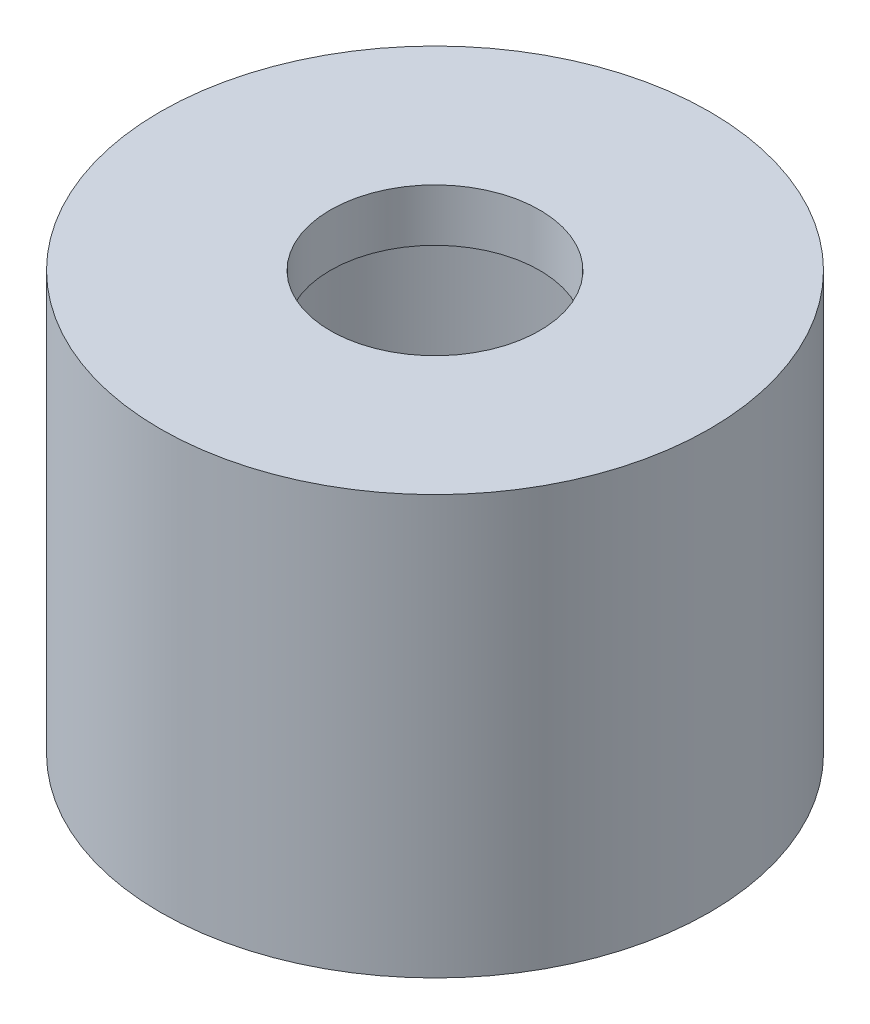
ISO-10303-21;
HEADER;
FILE_DESCRIPTION(('STEP AP214'),'2;1');
FILE_NAME('part.step','',(''),(''),'','','');
FILE_SCHEMA(('AUTOMOTIVE_DESIGN { 1 0 10303 214 1 1 1 1 }'));
ENDSEC;
DATA;
#1=APPLICATION_CONTEXT('core data for automotive mechanical design processes');
#2=APPLICATION_PROTOCOL_DEFINITION('international standard','automotive_design',2000,#1);
#3=PRODUCT_CONTEXT('',#1,'mechanical');
#4=PRODUCT('Part','Part','',(#3));
#5=PRODUCT_RELATED_PRODUCT_CATEGORY('part','',(#4));
#6=PRODUCT_DEFINITION_FORMATION('','',#4);
#7=PRODUCT_DEFINITION_CONTEXT('part definition',#1,'design');
#8=PRODUCT_DEFINITION('design','',#6,#7);
#9=PRODUCT_DEFINITION_SHAPE('','',#8);
#10=(LENGTH_UNIT() NAMED_UNIT(*) SI_UNIT(.MILLI.,.METRE.));
#11=(NAMED_UNIT(*) PLANE_ANGLE_UNIT() SI_UNIT($,.RADIAN.));
#12=(NAMED_UNIT(*) SI_UNIT($,.STERADIAN.) SOLID_ANGLE_UNIT());
#13=UNCERTAINTY_MEASURE_WITH_UNIT(LENGTH_MEASURE(1.E-05),#10,'distance_accuracy_value','');
#14=(GEOMETRIC_REPRESENTATION_CONTEXT(3) GLOBAL_UNCERTAINTY_ASSIGNED_CONTEXT((#13)) GLOBAL_UNIT_ASSIGNED_CONTEXT((#10,
#11,#12)) REPRESENTATION_CONTEXT('',''));
#15=CARTESIAN_POINT('',(0.,0.,0.));
#16=DIRECTION('',(0.,0.,1.));
#17=DIRECTION('',(1.,0.,0.));
#18=AXIS2_PLACEMENT_3D('',#15,#16,#17);
#19=CARTESIAN_POINT('',(0.,0.,0.));
#20=DIRECTION('',(0.,1.,0.));
#21=DIRECTION('',(-1.,0.,0.));
#22=AXIS2_PLACEMENT_3D('',#19,#20,#21);
#23=CYLINDRICAL_SURFACE('',#22,10.5);
#24=CARTESIAN_POINT('',(0.,-16.,0.));
#25=DIRECTION('',(0.,1.,0.));
#26=DIRECTION('',(-1.,0.,0.));
#27=AXIS2_PLACEMENT_3D('',#24,#25,#26);
#28=CIRCLE('',#27,10.5);
#29=CARTESIAN_POINT('',(-10.5,-16.,0.));
#30=VERTEX_POINT('',#29);
#31=EDGE_CURVE('E10',#30,#30,#28,.T.);
#32=ORIENTED_EDGE('',*,*,#31,.T.);
#33=EDGE_LOOP('',(#32));
#34=FACE_BOUND('',#33,.T.);
#35=CARTESIAN_POINT('',(0.,0.,0.));
#36=DIRECTION('',(0.,1.,0.));
#37=DIRECTION('',(-1.,0.,0.));
#38=AXIS2_PLACEMENT_3D('',#35,#36,#37);
#39=CIRCLE('',#38,10.5);
#40=CARTESIAN_POINT('',(-10.5,0.,0.));
#41=VERTEX_POINT('',#40);
#42=EDGE_CURVE('E50',#41,#41,#39,.T.);
#43=ORIENTED_EDGE('',*,*,#42,.F.);
#44=EDGE_LOOP('',(#43));
#45=FACE_BOUND('',#44,.T.);
#46=ADVANCED_FACE('F28',(#34,#45),#23,.T.);
#47=CARTESIAN_POINT('',(-10.5,-16.,0.));
#48=DIRECTION('',(0.,-1.,0.));
#49=DIRECTION('',(1.,0.,0.));
#50=AXIS2_PLACEMENT_3D('',#47,#48,#49);
#51=PLANE('',#50);
#52=CARTESIAN_POINT('',(0.,-16.,0.));
#53=DIRECTION('',(0.,1.,0.));
#54=DIRECTION('',(-1.,0.,0.));
#55=AXIS2_PLACEMENT_3D('',#52,#53,#54);
#56=CIRCLE('',#55,8.5);
#57=CARTESIAN_POINT('',(-8.5,-16.,0.));
#58=VERTEX_POINT('',#57);
#59=EDGE_CURVE('E34',#58,#58,#56,.T.);
#60=ORIENTED_EDGE('',*,*,#59,.T.);
#61=EDGE_LOOP('',(#60));
#62=FACE_BOUND('',#61,.T.);
#63=ORIENTED_EDGE('',*,*,#31,.F.);
#64=EDGE_LOOP('',(#63));
#65=FACE_BOUND('',#64,.T.);
#66=ADVANCED_FACE('F58',(#62,#65),#51,.T.);
#67=CARTESIAN_POINT('',(0.,0.,0.));
#68=DIRECTION('',(0.,1.,0.));
#69=DIRECTION('',(-1.,0.,0.));
#70=AXIS2_PLACEMENT_3D('',#67,#68,#69);
#71=CYLINDRICAL_SURFACE('',#70,8.5);
#72=CARTESIAN_POINT('',(0.,-2.,0.));
#73=DIRECTION('',(0.,1.,0.));
#74=DIRECTION('',(-1.,0.,0.));
#75=AXIS2_PLACEMENT_3D('',#72,#73,#74);
#76=CIRCLE('',#75,8.5);
#77=CARTESIAN_POINT('',(-8.5,-2.,0.));
#78=VERTEX_POINT('',#77);
#79=EDGE_CURVE('E38',#78,#78,#76,.T.);
#80=ORIENTED_EDGE('',*,*,#79,.T.);
#81=EDGE_LOOP('',(#80));
#82=FACE_BOUND('',#81,.T.);
#83=ORIENTED_EDGE('',*,*,#59,.F.);
#84=EDGE_LOOP('',(#83));
#85=FACE_BOUND('',#84,.T.);
#86=ADVANCED_FACE('F62',(#82,#85),#71,.F.);
#87=CARTESIAN_POINT('',(-8.5,-2.,0.));
#88=DIRECTION('',(0.,-1.,0.));
#89=DIRECTION('',(1.,0.,0.));
#90=AXIS2_PLACEMENT_3D('',#87,#88,#89);
#91=PLANE('',#90);
#92=CARTESIAN_POINT('',(0.,-2.,0.));
#93=DIRECTION('',(0.,1.,0.));
#94=DIRECTION('',(-1.,0.,0.));
#95=AXIS2_PLACEMENT_3D('',#92,#93,#94);
#96=CIRCLE('',#95,4.);
#97=CARTESIAN_POINT('',(-4.,-2.,0.));
#98=VERTEX_POINT('',#97);
#99=EDGE_CURVE('E42',#98,#98,#96,.T.);
#100=ORIENTED_EDGE('',*,*,#99,.T.);
#101=EDGE_LOOP('',(#100));
#102=FACE_BOUND('',#101,.T.);
#103=ORIENTED_EDGE('',*,*,#79,.F.);
#104=EDGE_LOOP('',(#103));
#105=FACE_BOUND('',#104,.T.);
#106=ADVANCED_FACE('F66',(#102,#105),#91,.T.);
#107=CARTESIAN_POINT('',(0.,0.,0.));
#108=DIRECTION('',(0.,1.,0.));
#109=DIRECTION('',(-1.,0.,0.));
#110=AXIS2_PLACEMENT_3D('',#107,#108,#109);
#111=CYLINDRICAL_SURFACE('',#110,4.);
#112=CARTESIAN_POINT('',(0.,0.,0.));
#113=DIRECTION('',(0.,1.,0.));
#114=DIRECTION('',(-1.,0.,0.));
#115=AXIS2_PLACEMENT_3D('',#112,#113,#114);
#116=CIRCLE('',#115,4.);
#117=CARTESIAN_POINT('',(-4.,0.,0.));
#118=VERTEX_POINT('',#117);
#119=EDGE_CURVE('E47',#118,#118,#116,.T.);
#120=ORIENTED_EDGE('',*,*,#119,.T.);
#121=EDGE_LOOP('',(#120));
#122=FACE_BOUND('',#121,.T.);
#123=ORIENTED_EDGE('',*,*,#99,.F.);
#124=EDGE_LOOP('',(#123));
#125=FACE_BOUND('',#124,.T.);
#126=ADVANCED_FACE('F73',(#122,#125),#111,.F.);
#127=CARTESIAN_POINT('',(-10.5,0.,0.));
#128=DIRECTION('',(0.,1.,0.));
#129=DIRECTION('',(-1.,0.,0.));
#130=AXIS2_PLACEMENT_3D('',#127,#128,#129);
#131=PLANE('',#130);
#132=ORIENTED_EDGE('',*,*,#42,.T.);
#133=EDGE_LOOP('',(#132));
#134=FACE_BOUND('',#133,.T.);
#135=ORIENTED_EDGE('',*,*,#119,.F.);
#136=EDGE_LOOP('',(#135));
#137=FACE_BOUND('',#136,.T.);
#138=ADVANCED_FACE('F54',(#134,#137),#131,.T.);
#139=CLOSED_SHELL('',(#46,#66,#86,#106,#126,#138));
#140=MANIFOLD_SOLID_BREP('B2',#139);
#141=ADVANCED_BREP_SHAPE_REPRESENTATION('',(#18,#140),#14);
#142=SHAPE_DEFINITION_REPRESENTATION(#9,#141);
ENDSEC;
END-ISO-10303-21;
